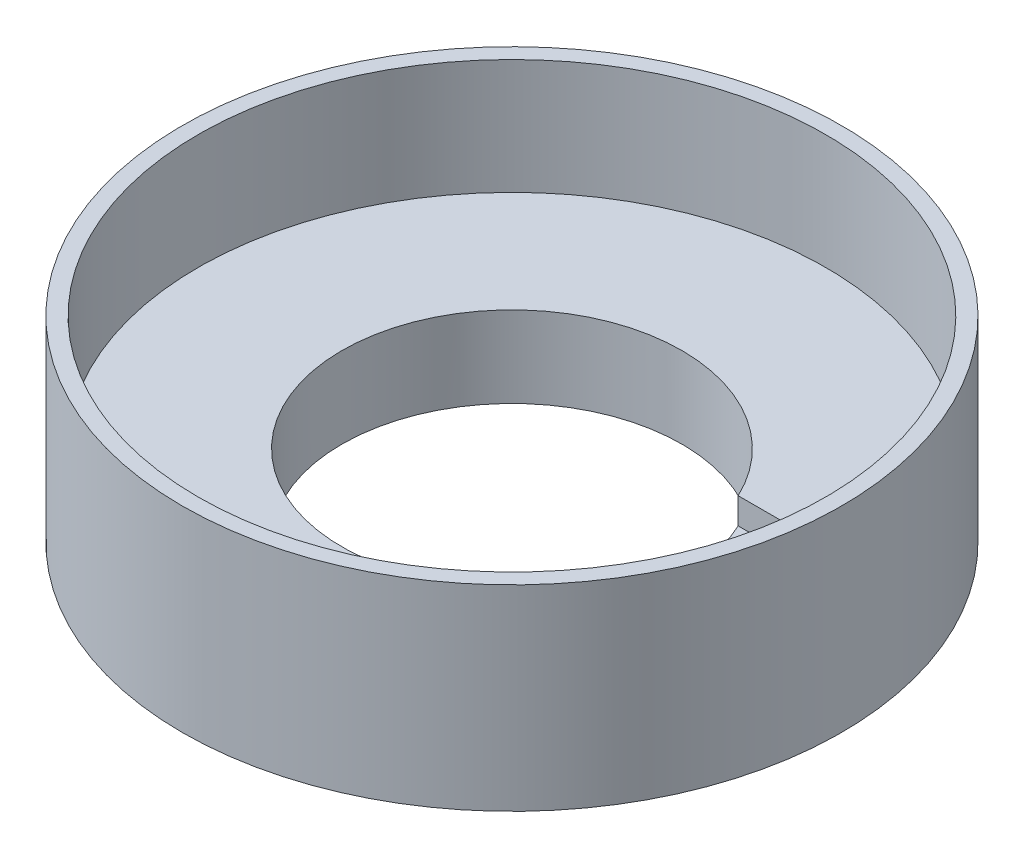
ISO-10303-21;
HEADER;
FILE_DESCRIPTION(('STEP AP214'),'2;1');
FILE_NAME('part.step','',(''),(''),'','','');
FILE_SCHEMA(('AUTOMOTIVE_DESIGN { 1 0 10303 214 1 1 1 1 }'));
ENDSEC;
DATA;
#1=APPLICATION_CONTEXT('core data for automotive mechanical design processes');
#2=APPLICATION_PROTOCOL_DEFINITION('international standard','automotive_design',2000,#1);
#3=PRODUCT_CONTEXT('',#1,'mechanical');
#4=PRODUCT('Part','Part','',(#3));
#5=PRODUCT_RELATED_PRODUCT_CATEGORY('part','',(#4));
#6=PRODUCT_DEFINITION_FORMATION('','',#4);
#7=PRODUCT_DEFINITION_CONTEXT('part definition',#1,'design');
#8=PRODUCT_DEFINITION('design','',#6,#7);
#9=PRODUCT_DEFINITION_SHAPE('','',#8);
#10=(LENGTH_UNIT() NAMED_UNIT(*) SI_UNIT(.MILLI.,.METRE.));
#11=(NAMED_UNIT(*) PLANE_ANGLE_UNIT() SI_UNIT($,.RADIAN.));
#12=(NAMED_UNIT(*) SI_UNIT($,.STERADIAN.) SOLID_ANGLE_UNIT());
#13=UNCERTAINTY_MEASURE_WITH_UNIT(LENGTH_MEASURE(1.E-05),#10,'distance_accuracy_value','');
#14=(GEOMETRIC_REPRESENTATION_CONTEXT(3) GLOBAL_UNCERTAINTY_ASSIGNED_CONTEXT((#13)) GLOBAL_UNIT_ASSIGNED_CONTEXT((#10,
#11,#12)) REPRESENTATION_CONTEXT('',''));
#15=CARTESIAN_POINT('',(0.,0.,0.));
#16=DIRECTION('',(0.,0.,1.));
#17=DIRECTION('',(1.,0.,0.));
#18=AXIS2_PLACEMENT_3D('',#15,#16,#17);
#19=CARTESIAN_POINT('',(0.,15.5,0.));
#20=DIRECTION('',(0.,1.,0.));
#21=DIRECTION('',(0.,0.,1.));
#22=AXIS2_PLACEMENT_3D('',#19,#20,#21);
#23=PLANE('',#22);
#24=DIRECTION('',(1.,0.,0.));
#25=VECTOR('',#24,1.);
#26=CARTESIAN_POINT('',(19.9548300688578,15.5,10.4109530083848));
#27=LINE('',#26,#25);
#28=CARTESIAN_POINT('',(30.7873684724304,15.5,10.4109530083848));
#29=VERTEX_POINT('',#28);
#30=CARTESIAN_POINT('',(44.9548300688579,15.5,10.4109530083848));
#31=VERTEX_POINT('',#30);
#32=EDGE_CURVE('E103',#29,#31,#27,.T.);
#33=ORIENTED_EDGE('',*,*,#32,.F.);
#34=CARTESIAN_POINT('',(0.,15.5,0.));
#35=DIRECTION('',(0.,1.,0.));
#36=DIRECTION('',(0.,0.,1.));
#37=AXIS2_PLACEMENT_3D('',#34,#35,#36);
#38=CIRCLE('',#37,32.5);
#39=CARTESIAN_POINT('',(29.4073903777205,15.5,-13.8367406267643));
#40=VERTEX_POINT('',#39);
#41=EDGE_CURVE('E126',#40,#29,#38,.T.);
#42=ORIENTED_EDGE('',*,*,#41,.F.);
#43=DIRECTION('',(-1.,0.,0.));
#44=VECTOR('',#43,1.);
#45=CARTESIAN_POINT('',(19.9548300688578,15.5,-13.8367406267643));
#46=LINE('',#45,#44);
#47=CARTESIAN_POINT('',(44.9548300688579,15.5,-13.8367406267643));
#48=VERTEX_POINT('',#47);
#49=EDGE_CURVE('E106',#48,#40,#46,.T.);
#50=ORIENTED_EDGE('',*,*,#49,.F.);
#51=DIRECTION('',(0.,0.,-1.));
#52=VECTOR('',#51,1.);
#53=CARTESIAN_POINT('',(44.9548300688579,15.5,10.4109530083848));
#54=LINE('',#53,#52);
#55=EDGE_CURVE('E89',#31,#48,#54,.T.);
#56=ORIENTED_EDGE('',*,*,#55,.F.);
#57=EDGE_LOOP('',(#33,#42,#50,#56));
#58=FACE_BOUND('',#57,.T.);
#59=CARTESIAN_POINT('',(0.,15.5,0.));
#60=DIRECTION('',(0.,1.,0.));
#61=DIRECTION('',(0.,0.,1.));
#62=AXIS2_PLACEMENT_3D('',#59,#60,#61);
#63=CIRCLE('',#62,60.);
#64=CARTESIAN_POINT('',(0.,15.5,60.));
#65=VERTEX_POINT('',#64);
#66=EDGE_CURVE('E137',#65,#65,#63,.F.);
#67=ORIENTED_EDGE('',*,*,#66,.F.);
#68=EDGE_LOOP('',(#67));
#69=FACE_BOUND('',#68,.T.);
#70=ADVANCED_FACE('F43',(#58,#69),#23,.T.);
#71=CARTESIAN_POINT('',(0.,0.,0.));
#72=DIRECTION('',(0.,1.,0.));
#73=DIRECTION('',(0.,0.,1.));
#74=AXIS2_PLACEMENT_3D('',#71,#72,#73);
#75=PLANE('',#74);
#76=CARTESIAN_POINT('',(0.,0.,0.));
#77=DIRECTION('',(0.,1.,0.));
#78=DIRECTION('',(0.,0.,1.));
#79=AXIS2_PLACEMENT_3D('',#76,#77,#78);
#80=CIRCLE('',#79,63.);
#81=CARTESIAN_POINT('',(0.,0.,63.));
#82=VERTEX_POINT('',#81);
#83=EDGE_CURVE('E130',#82,#82,#80,.T.);
#84=ORIENTED_EDGE('',*,*,#83,.F.);
#85=EDGE_LOOP('',(#84));
#86=FACE_BOUND('',#85,.T.);
#87=CARTESIAN_POINT('',(0.,0.,0.));
#88=DIRECTION('',(0.,1.,0.));
#89=DIRECTION('',(0.,0.,1.));
#90=AXIS2_PLACEMENT_3D('',#87,#88,#89);
#91=CIRCLE('',#90,32.5);
#92=CARTESIAN_POINT('',(0.,0.,32.5));
#93=VERTEX_POINT('',#92);
#94=EDGE_CURVE('E125',#93,#93,#91,.T.);
#95=ORIENTED_EDGE('',*,*,#94,.T.);
#96=EDGE_LOOP('',(#95));
#97=FACE_BOUND('',#96,.T.);
#98=ADVANCED_FACE('F148',(#86,#97),#75,.F.);
#99=CARTESIAN_POINT('',(0.,15.5,0.));
#100=DIRECTION('',(0.,-1.,0.));
#101=DIRECTION('',(0.,0.,-1.));
#102=AXIS2_PLACEMENT_3D('',#99,#100,#101);
#103=CYLINDRICAL_SURFACE('',#102,63.);
#104=ORIENTED_EDGE('',*,*,#83,.T.);
#105=EDGE_LOOP('',(#104));
#106=FACE_BOUND('',#105,.T.);
#107=CARTESIAN_POINT('',(0.,37.5,0.));
#108=DIRECTION('',(0.,1.,0.));
#109=DIRECTION('',(0.,0.,1.));
#110=AXIS2_PLACEMENT_3D('',#107,#108,#109);
#111=CIRCLE('',#110,63.);
#112=CARTESIAN_POINT('',(0.,37.5,63.));
#113=VERTEX_POINT('',#112);
#114=EDGE_CURVE('E121',#113,#113,#111,.T.);
#115=ORIENTED_EDGE('',*,*,#114,.F.);
#116=EDGE_LOOP('',(#115));
#117=FACE_BOUND('',#116,.T.);
#118=ADVANCED_FACE('F45',(#106,#117),#103,.T.);
#119=CARTESIAN_POINT('',(0.,15.5,0.));
#120=DIRECTION('',(0.,-1.,0.));
#121=DIRECTION('',(0.,0.,-1.));
#122=AXIS2_PLACEMENT_3D('',#119,#120,#121);
#123=CYLINDRICAL_SURFACE('',#122,32.5);
#124=DIRECTION('',(0.,-1.,0.));
#125=VECTOR('',#124,1.);
#126=CARTESIAN_POINT('',(30.7873684724304,15.5,10.4109530083848));
#127=LINE('',#126,#125);
#128=CARTESIAN_POINT('',(30.7873684724304,10.5,10.4109530083848));
#129=VERTEX_POINT('',#128);
#130=EDGE_CURVE('E11',#129,#29,#127,.F.);
#131=ORIENTED_EDGE('',*,*,#130,.F.);
#132=CARTESIAN_POINT('',(0.,10.5,0.));
#133=DIRECTION('',(0.,-1.,0.));
#134=DIRECTION('',(0.,0.,-1.));
#135=AXIS2_PLACEMENT_3D('',#132,#133,#134);
#136=CIRCLE('',#135,32.5);
#137=CARTESIAN_POINT('',(29.4073903777205,10.5,-13.8367406267643));
#138=VERTEX_POINT('',#137);
#139=EDGE_CURVE('E64',#138,#129,#136,.T.);
#140=ORIENTED_EDGE('',*,*,#139,.F.);
#141=DIRECTION('',(0.,-1.,0.));
#142=VECTOR('',#141,1.);
#143=CARTESIAN_POINT('',(29.4073903777205,15.5,-13.8367406267643));
#144=LINE('',#143,#142);
#145=EDGE_CURVE('E52',#40,#138,#144,.T.);
#146=ORIENTED_EDGE('',*,*,#145,.F.);
#147=ORIENTED_EDGE('',*,*,#41,.T.);
#148=EDGE_LOOP('',(#131,#140,#146,#147));
#149=FACE_BOUND('',#148,.T.);
#150=ORIENTED_EDGE('',*,*,#94,.F.);
#151=EDGE_LOOP('',(#150));
#152=FACE_BOUND('',#151,.T.);
#153=ADVANCED_FACE('F157',(#149,#152),#123,.F.);
#154=CARTESIAN_POINT('',(0.,37.5,0.));
#155=DIRECTION('',(0.,1.,0.));
#156=DIRECTION('',(0.,0.,1.));
#157=AXIS2_PLACEMENT_3D('',#154,#155,#156);
#158=PLANE('',#157);
#159=ORIENTED_EDGE('',*,*,#114,.T.);
#160=EDGE_LOOP('',(#159));
#161=FACE_BOUND('',#160,.T.);
#162=CARTESIAN_POINT('',(0.,37.5,0.));
#163=DIRECTION('',(0.,1.,0.));
#164=DIRECTION('',(0.,0.,1.));
#165=AXIS2_PLACEMENT_3D('',#162,#163,#164);
#166=CIRCLE('',#165,60.);
#167=CARTESIAN_POINT('',(0.,37.5,60.));
#168=VERTEX_POINT('',#167);
#169=EDGE_CURVE('E116',#168,#168,#166,.T.);
#170=ORIENTED_EDGE('',*,*,#169,.F.);
#171=EDGE_LOOP('',(#170));
#172=FACE_BOUND('',#171,.T.);
#173=ADVANCED_FACE('F160',(#161,#172),#158,.T.);
#174=CARTESIAN_POINT('',(0.,37.5,0.));
#175=DIRECTION('',(0.,-1.,0.));
#176=DIRECTION('',(0.,0.,-1.));
#177=AXIS2_PLACEMENT_3D('',#174,#175,#176);
#178=CYLINDRICAL_SURFACE('',#177,60.);
#179=ORIENTED_EDGE('',*,*,#169,.T.);
#180=EDGE_LOOP('',(#179));
#181=FACE_BOUND('',#180,.T.);
#182=ORIENTED_EDGE('',*,*,#66,.T.);
#183=EDGE_LOOP('',(#182));
#184=FACE_BOUND('',#183,.T.);
#185=ADVANCED_FACE('F145',(#181,#184),#178,.F.);
#186=CARTESIAN_POINT('',(44.9548300688579,10.5,10.4109530083848));
#187=DIRECTION('',(1.,0.,0.));
#188=DIRECTION('',(0.,0.,-1.));
#189=AXIS2_PLACEMENT_3D('',#186,#187,#188);
#190=PLANE('',#189);
#191=ORIENTED_EDGE('',*,*,#55,.T.);
#192=DIRECTION('',(0.,1.,0.));
#193=VECTOR('',#192,1.);
#194=CARTESIAN_POINT('',(44.9548300688579,10.5,-13.8367406267643));
#195=LINE('',#194,#193);
#196=CARTESIAN_POINT('',(44.9548300688579,10.5,-13.8367406267643));
#197=VERTEX_POINT('',#196);
#198=EDGE_CURVE('E84',#197,#48,#195,.T.);
#199=ORIENTED_EDGE('',*,*,#198,.F.);
#200=DIRECTION('',(0.,0.,-1.));
#201=VECTOR('',#200,1.);
#202=CARTESIAN_POINT('',(44.9548300688579,10.5,10.4109530083848));
#203=LINE('',#202,#201);
#204=CARTESIAN_POINT('',(44.9548300688579,10.5,10.4109530083848));
#205=VERTEX_POINT('',#204);
#206=EDGE_CURVE('E87',#205,#197,#203,.T.);
#207=ORIENTED_EDGE('',*,*,#206,.F.);
#208=DIRECTION('',(0.,1.,0.));
#209=VECTOR('',#208,1.);
#210=CARTESIAN_POINT('',(44.9548300688579,10.5,10.4109530083848));
#211=LINE('',#210,#209);
#212=EDGE_CURVE('E93',#205,#31,#211,.T.);
#213=ORIENTED_EDGE('',*,*,#212,.T.);
#214=EDGE_LOOP('',(#191,#199,#207,#213));
#215=FACE_BOUND('',#214,.T.);
#216=ADVANCED_FACE('F85',(#215),#190,.F.);
#217=CARTESIAN_POINT('',(19.9548300688578,10.5,10.4109530083848));
#218=DIRECTION('',(0.,0.,1.));
#219=DIRECTION('',(1.,0.,0.));
#220=AXIS2_PLACEMENT_3D('',#217,#218,#219);
#221=PLANE('',#220);
#222=ORIENTED_EDGE('',*,*,#130,.T.);
#223=ORIENTED_EDGE('',*,*,#32,.T.);
#224=ORIENTED_EDGE('',*,*,#212,.F.);
#225=DIRECTION('',(1.,0.,0.));
#226=VECTOR('',#225,1.);
#227=CARTESIAN_POINT('',(19.9548300688578,10.5,10.4109530083848));
#228=LINE('',#227,#226);
#229=EDGE_CURVE('E94',#129,#205,#228,.T.);
#230=ORIENTED_EDGE('',*,*,#229,.F.);
#231=EDGE_LOOP('',(#222,#223,#224,#230));
#232=FACE_BOUND('',#231,.T.);
#233=ADVANCED_FACE('F170',(#232),#221,.F.);
#234=CARTESIAN_POINT('',(19.9548300688578,10.5,-13.8367406267643));
#235=DIRECTION('',(0.,0.,-1.));
#236=DIRECTION('',(-1.,0.,0.));
#237=AXIS2_PLACEMENT_3D('',#234,#235,#236);
#238=PLANE('',#237);
#239=ORIENTED_EDGE('',*,*,#145,.T.);
#240=DIRECTION('',(-1.,0.,0.));
#241=VECTOR('',#240,1.);
#242=CARTESIAN_POINT('',(19.9548300688578,10.5,-13.8367406267643));
#243=LINE('',#242,#241);
#244=EDGE_CURVE('E59',#197,#138,#243,.T.);
#245=ORIENTED_EDGE('',*,*,#244,.F.);
#246=ORIENTED_EDGE('',*,*,#198,.T.);
#247=ORIENTED_EDGE('',*,*,#49,.T.);
#248=EDGE_LOOP('',(#239,#245,#246,#247));
#249=FACE_BOUND('',#248,.T.);
#250=ADVANCED_FACE('F96',(#249),#238,.F.);
#251=CARTESIAN_POINT('',(0.,10.5,0.));
#252=DIRECTION('',(0.,-1.,0.));
#253=DIRECTION('',(0.,0.,-1.));
#254=AXIS2_PLACEMENT_3D('',#251,#252,#253);
#255=PLANE('',#254);
#256=ORIENTED_EDGE('',*,*,#139,.T.);
#257=ORIENTED_EDGE('',*,*,#229,.T.);
#258=ORIENTED_EDGE('',*,*,#206,.T.);
#259=ORIENTED_EDGE('',*,*,#244,.T.);
#260=EDGE_LOOP('',(#256,#257,#258,#259));
#261=FACE_BOUND('',#260,.T.);
#262=ADVANCED_FACE('F100',(#261),#255,.F.);
#263=CLOSED_SHELL('',(#70,#98,#118,#153,#173,#185,#216,#233,#250,#262));
#264=MANIFOLD_SOLID_BREP('B2',#263);
#265=ADVANCED_BREP_SHAPE_REPRESENTATION('',(#18,#264),#14);
#266=SHAPE_DEFINITION_REPRESENTATION(#9,#265);
ENDSEC;
END-ISO-10303-21;
